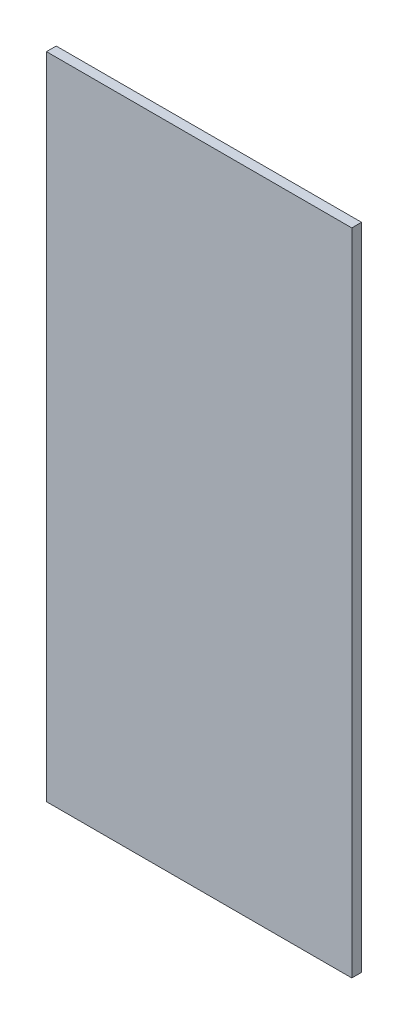
ISO-10303-21;
HEADER;
FILE_DESCRIPTION(('STEP AP214'),'2;1');
FILE_NAME('part.step','',(''),(''),'','','');
FILE_SCHEMA(('AUTOMOTIVE_DESIGN { 1 0 10303 214 1 1 1 1 }'));
ENDSEC;
DATA;
#1=APPLICATION_CONTEXT('core data for automotive mechanical design processes');
#2=APPLICATION_PROTOCOL_DEFINITION('international standard','automotive_design',2000,#1);
#3=PRODUCT_CONTEXT('',#1,'mechanical');
#4=PRODUCT('Part','Part','',(#3));
#5=PRODUCT_RELATED_PRODUCT_CATEGORY('part','',(#4));
#6=PRODUCT_DEFINITION_FORMATION('','',#4);
#7=PRODUCT_DEFINITION_CONTEXT('part definition',#1,'design');
#8=PRODUCT_DEFINITION('design','',#6,#7);
#9=PRODUCT_DEFINITION_SHAPE('','',#8);
#10=(LENGTH_UNIT() NAMED_UNIT(*) SI_UNIT(.MILLI.,.METRE.));
#11=(NAMED_UNIT(*) PLANE_ANGLE_UNIT() SI_UNIT($,.RADIAN.));
#12=(NAMED_UNIT(*) SI_UNIT($,.STERADIAN.) SOLID_ANGLE_UNIT());
#13=UNCERTAINTY_MEASURE_WITH_UNIT(LENGTH_MEASURE(1.E-05),#10,'distance_accuracy_value','');
#14=(GEOMETRIC_REPRESENTATION_CONTEXT(3) GLOBAL_UNCERTAINTY_ASSIGNED_CONTEXT((#13)) GLOBAL_UNIT_ASSIGNED_CONTEXT((#10,
#11,#12)) REPRESENTATION_CONTEXT('',''));
#15=CARTESIAN_POINT('',(0.,0.,0.));
#16=DIRECTION('',(0.,0.,1.));
#17=DIRECTION('',(1.,0.,0.));
#18=AXIS2_PLACEMENT_3D('',#15,#16,#17);
#19=CARTESIAN_POINT('',(53.,0.,97.));
#20=DIRECTION('',(0.,-1.,0.));
#21=DIRECTION('',(0.,0.,-1.));
#22=AXIS2_PLACEMENT_3D('',#19,#20,#21);
#23=PLANE('',#22);
#24=DIRECTION('',(1.,0.,0.));
#25=VECTOR('',#24,1.);
#26=CARTESIAN_POINT('',(3.,0.,97.));
#27=LINE('',#26,#25);
#28=CARTESIAN_POINT('',(3.,0.,97.));
#29=VERTEX_POINT('',#28);
#30=CARTESIAN_POINT('',(97.,0.,97.));
#31=VERTEX_POINT('',#30);
#32=EDGE_CURVE('E11',#29,#31,#27,.T.);
#33=ORIENTED_EDGE('',*,*,#32,.T.);
#34=DIRECTION('',(0.,0.,1.));
#35=VECTOR('',#34,1.);
#36=CARTESIAN_POINT('',(97.,0.,97.));
#37=LINE('',#36,#35);
#38=CARTESIAN_POINT('',(97.,0.,100.));
#39=VERTEX_POINT('',#38);
#40=EDGE_CURVE('E79',#31,#39,#37,.T.);
#41=ORIENTED_EDGE('',*,*,#40,.T.);
#42=DIRECTION('',(-1.,0.,0.));
#43=VECTOR('',#42,1.);
#44=CARTESIAN_POINT('',(97.,0.,100.));
#45=LINE('',#44,#43);
#46=CARTESIAN_POINT('',(3.,0.,100.));
#47=VERTEX_POINT('',#46);
#48=EDGE_CURVE('E73',#39,#47,#45,.T.);
#49=ORIENTED_EDGE('',*,*,#48,.T.);
#50=DIRECTION('',(0.,0.,-1.));
#51=VECTOR('',#50,1.);
#52=CARTESIAN_POINT('',(3.,0.,100.));
#53=LINE('',#52,#51);
#54=EDGE_CURVE('E76',#47,#29,#53,.T.);
#55=ORIENTED_EDGE('',*,*,#54,.T.);
#56=EDGE_LOOP('',(#33,#41,#49,#55));
#57=FACE_BOUND('',#56,.T.);
#58=ADVANCED_FACE('F17',(#57),#23,.T.);
#59=CARTESIAN_POINT('',(53.,200.,97.));
#60=DIRECTION('',(0.,1.,0.));
#61=DIRECTION('',(1.,0.,0.));
#62=AXIS2_PLACEMENT_3D('',#59,#60,#61);
#63=PLANE('',#62);
#64=DIRECTION('',(1.,0.,0.));
#65=VECTOR('',#64,1.);
#66=CARTESIAN_POINT('',(3.,200.,97.));
#67=LINE('',#66,#65);
#68=CARTESIAN_POINT('',(3.,200.,97.));
#69=VERTEX_POINT('',#68);
#70=CARTESIAN_POINT('',(97.,200.,97.));
#71=VERTEX_POINT('',#70);
#72=EDGE_CURVE('E28',#69,#71,#67,.T.);
#73=ORIENTED_EDGE('',*,*,#72,.F.);
#74=DIRECTION('',(0.,0.,-1.));
#75=VECTOR('',#74,1.);
#76=CARTESIAN_POINT('',(3.,200.,100.));
#77=LINE('',#76,#75);
#78=CARTESIAN_POINT('',(3.,200.,100.));
#79=VERTEX_POINT('',#78);
#80=EDGE_CURVE('E102',#79,#69,#77,.T.);
#81=ORIENTED_EDGE('',*,*,#80,.F.);
#82=DIRECTION('',(-1.,0.,0.));
#83=VECTOR('',#82,1.);
#84=CARTESIAN_POINT('',(97.,200.,100.));
#85=LINE('',#84,#83);
#86=CARTESIAN_POINT('',(97.,200.,100.));
#87=VERTEX_POINT('',#86);
#88=EDGE_CURVE('E85',#87,#79,#85,.T.);
#89=ORIENTED_EDGE('',*,*,#88,.F.);
#90=DIRECTION('',(0.,0.,1.));
#91=VECTOR('',#90,1.);
#92=CARTESIAN_POINT('',(97.,200.,97.));
#93=LINE('',#92,#91);
#94=EDGE_CURVE('E21',#71,#87,#93,.T.);
#95=ORIENTED_EDGE('',*,*,#94,.F.);
#96=EDGE_LOOP('',(#73,#81,#89,#95));
#97=FACE_BOUND('',#96,.T.);
#98=ADVANCED_FACE('F180',(#97),#63,.T.);
#99=CARTESIAN_POINT('',(3.,200.,97.));
#100=DIRECTION('',(0.,0.,-1.));
#101=DIRECTION('',(-1.,0.,0.));
#102=AXIS2_PLACEMENT_3D('',#99,#100,#101);
#103=PLANE('',#102);
#104=ORIENTED_EDGE('',*,*,#72,.T.);
#105=DIRECTION('',(0.,-1.,0.));
#106=VECTOR('',#105,1.);
#107=CARTESIAN_POINT('',(97.,200.,97.));
#108=LINE('',#107,#106);
#109=EDGE_CURVE('E111',#71,#31,#108,.T.);
#110=ORIENTED_EDGE('',*,*,#109,.T.);
#111=ORIENTED_EDGE('',*,*,#32,.F.);
#112=DIRECTION('',(0.,-1.,0.));
#113=VECTOR('',#112,1.);
#114=CARTESIAN_POINT('',(3.,200.,97.));
#115=LINE('',#114,#113);
#116=EDGE_CURVE('E95',#69,#29,#115,.T.);
#117=ORIENTED_EDGE('',*,*,#116,.F.);
#118=EDGE_LOOP('',(#104,#110,#111,#117));
#119=FACE_BOUND('',#118,.T.);
#120=ADVANCED_FACE('F19',(#119),#103,.T.);
#121=CARTESIAN_POINT('',(97.,200.,97.));
#122=DIRECTION('',(1.,0.,0.));
#123=DIRECTION('',(0.,0.,-1.));
#124=AXIS2_PLACEMENT_3D('',#121,#122,#123);
#125=PLANE('',#124);
#126=ORIENTED_EDGE('',*,*,#94,.T.);
#127=DIRECTION('',(0.,-1.,0.));
#128=VECTOR('',#127,1.);
#129=CARTESIAN_POINT('',(97.,200.,100.));
#130=LINE('',#129,#128);
#131=EDGE_CURVE('E84',#87,#39,#130,.T.);
#132=ORIENTED_EDGE('',*,*,#131,.T.);
#133=ORIENTED_EDGE('',*,*,#40,.F.);
#134=ORIENTED_EDGE('',*,*,#109,.F.);
#135=EDGE_LOOP('',(#126,#132,#133,#134));
#136=FACE_BOUND('',#135,.T.);
#137=ADVANCED_FACE('F162',(#136),#125,.T.);
#138=CARTESIAN_POINT('',(97.,200.,100.));
#139=DIRECTION('',(0.,0.,1.));
#140=DIRECTION('',(1.,0.,0.));
#141=AXIS2_PLACEMENT_3D('',#138,#139,#140);
#142=PLANE('',#141);
#143=ORIENTED_EDGE('',*,*,#88,.T.);
#144=DIRECTION('',(0.,-1.,0.));
#145=VECTOR('',#144,1.);
#146=CARTESIAN_POINT('',(3.,200.,100.));
#147=LINE('',#146,#145);
#148=EDGE_CURVE('E87',#79,#47,#147,.T.);
#149=ORIENTED_EDGE('',*,*,#148,.T.);
#150=ORIENTED_EDGE('',*,*,#48,.F.);
#151=ORIENTED_EDGE('',*,*,#131,.F.);
#152=EDGE_LOOP('',(#143,#149,#150,#151));
#153=FACE_BOUND('',#152,.T.);
#154=ADVANCED_FACE('F88',(#153),#142,.T.);
#155=CARTESIAN_POINT('',(3.,200.,100.));
#156=DIRECTION('',(-1.,0.,0.));
#157=DIRECTION('',(0.,1.,0.));
#158=AXIS2_PLACEMENT_3D('',#155,#156,#157);
#159=PLANE('',#158);
#160=ORIENTED_EDGE('',*,*,#80,.T.);
#161=ORIENTED_EDGE('',*,*,#116,.T.);
#162=ORIENTED_EDGE('',*,*,#54,.F.);
#163=ORIENTED_EDGE('',*,*,#148,.F.);
#164=EDGE_LOOP('',(#160,#161,#162,#163));
#165=FACE_BOUND('',#164,.T.);
#166=ADVANCED_FACE('F94',(#165),#159,.T.);
#167=CLOSED_SHELL('',(#58,#98,#120,#137,#154,#166));
#168=MANIFOLD_SOLID_BREP('B1',#167);
#169=ADVANCED_BREP_SHAPE_REPRESENTATION('',(#18,#168),#14);
#170=SHAPE_DEFINITION_REPRESENTATION(#9,#169);
ENDSEC;
END-ISO-10303-21;
